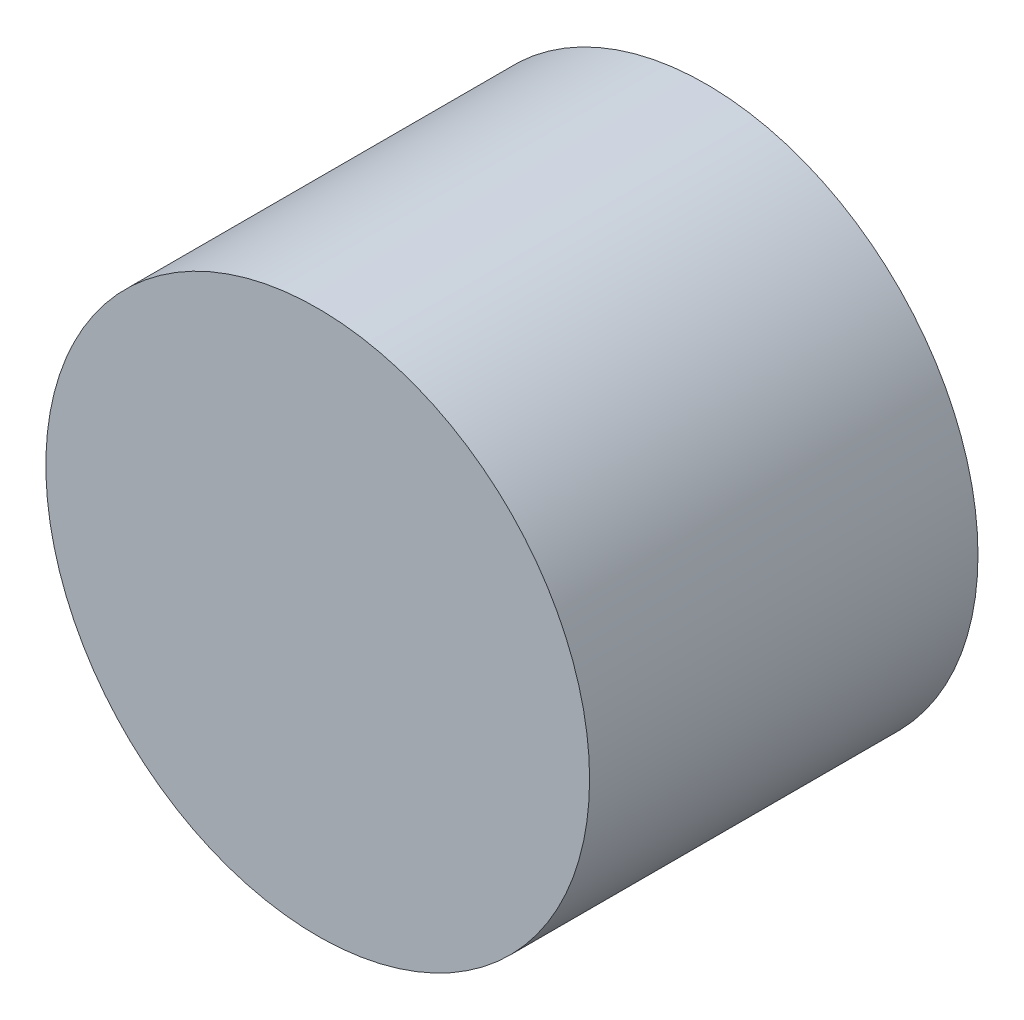
ISO-10303-21;
HEADER;
FILE_DESCRIPTION(('STEP AP214'),'2;1');
FILE_NAME('part.step','',(''),(''),'','','');
FILE_SCHEMA(('AUTOMOTIVE_DESIGN { 1 0 10303 214 1 1 1 1 }'));
ENDSEC;
DATA;
#1=APPLICATION_CONTEXT('core data for automotive mechanical design processes');
#2=APPLICATION_PROTOCOL_DEFINITION('international standard','automotive_design',2000,#1);
#3=PRODUCT_CONTEXT('',#1,'mechanical');
#4=PRODUCT('Part','Part','',(#3));
#5=PRODUCT_RELATED_PRODUCT_CATEGORY('part','',(#4));
#6=PRODUCT_DEFINITION_FORMATION('','',#4);
#7=PRODUCT_DEFINITION_CONTEXT('part definition',#1,'design');
#8=PRODUCT_DEFINITION('design','',#6,#7);
#9=PRODUCT_DEFINITION_SHAPE('','',#8);
#10=(LENGTH_UNIT() NAMED_UNIT(*) SI_UNIT(.MILLI.,.METRE.));
#11=(NAMED_UNIT(*) PLANE_ANGLE_UNIT() SI_UNIT($,.RADIAN.));
#12=(NAMED_UNIT(*) SI_UNIT($,.STERADIAN.) SOLID_ANGLE_UNIT());
#13=UNCERTAINTY_MEASURE_WITH_UNIT(LENGTH_MEASURE(1.E-05),#10,'distance_accuracy_value','');
#14=(GEOMETRIC_REPRESENTATION_CONTEXT(3) GLOBAL_UNCERTAINTY_ASSIGNED_CONTEXT((#13)) GLOBAL_UNIT_ASSIGNED_CONTEXT((#10,
#11,#12)) REPRESENTATION_CONTEXT('',''));
#15=CARTESIAN_POINT('',(0.,0.,0.));
#16=DIRECTION('',(0.,0.,1.));
#17=DIRECTION('',(1.,0.,0.));
#18=AXIS2_PLACEMENT_3D('',#15,#16,#17);
#19=CARTESIAN_POINT('',(-4.75410201159471,3.97833760996837,5.));
#20=DIRECTION('',(0.,0.,-1.));
#21=DIRECTION('',(-1.,0.,0.));
#22=AXIS2_PLACEMENT_3D('',#19,#20,#21);
#23=CYLINDRICAL_SURFACE('',#22,3.5);
#24=CARTESIAN_POINT('',(-4.75410201159471,3.97833760996837,5.));
#25=DIRECTION('',(0.,0.,1.));
#26=DIRECTION('',(1.,0.,0.));
#27=AXIS2_PLACEMENT_3D('',#24,#25,#26);
#28=CIRCLE('',#27,3.5);
#29=CARTESIAN_POINT('',(-1.25410201159471,3.97833760996837,5.));
#30=VERTEX_POINT('',#29);
#31=EDGE_CURVE('E10',#30,#30,#28,.T.);
#32=ORIENTED_EDGE('',*,*,#31,.F.);
#33=EDGE_LOOP('',(#32));
#34=FACE_BOUND('',#33,.T.);
#35=CARTESIAN_POINT('',(-4.75410201159471,3.97833760996837,0.));
#36=DIRECTION('',(0.,0.,1.));
#37=DIRECTION('',(1.,0.,0.));
#38=AXIS2_PLACEMENT_3D('',#35,#36,#37);
#39=CIRCLE('',#38,3.5);
#40=CARTESIAN_POINT('',(-1.25410201159471,3.97833760996837,0.));
#41=VERTEX_POINT('',#40);
#42=EDGE_CURVE('E33',#41,#41,#39,.T.);
#43=ORIENTED_EDGE('',*,*,#42,.T.);
#44=EDGE_LOOP('',(#43));
#45=FACE_BOUND('',#44,.T.);
#46=ADVANCED_FACE('F30',(#34,#45),#23,.T.);
#47=CARTESIAN_POINT('',(-4.75410201159471,3.97833760996837,5.));
#48=DIRECTION('',(0.,0.,1.));
#49=DIRECTION('',(1.,0.,0.));
#50=AXIS2_PLACEMENT_3D('',#47,#48,#49);
#51=PLANE('',#50);
#52=ORIENTED_EDGE('',*,*,#31,.T.);
#53=EDGE_LOOP('',(#52));
#54=FACE_BOUND('',#53,.T.);
#55=ADVANCED_FACE('F45',(#54),#51,.T.);
#56=CARTESIAN_POINT('',(-4.75410201159471,3.97833760996837,0.));
#57=DIRECTION('',(0.,0.,1.));
#58=DIRECTION('',(1.,0.,0.));
#59=AXIS2_PLACEMENT_3D('',#56,#57,#58);
#60=PLANE('',#59);
#61=ORIENTED_EDGE('',*,*,#42,.F.);
#62=EDGE_LOOP('',(#61));
#63=FACE_BOUND('',#62,.T.);
#64=ADVANCED_FACE('F43',(#63),#60,.F.);
#65=CLOSED_SHELL('',(#46,#55,#64));
#66=MANIFOLD_SOLID_BREP('B2',#65);
#67=ADVANCED_BREP_SHAPE_REPRESENTATION('',(#18,#66),#14);
#68=SHAPE_DEFINITION_REPRESENTATION(#9,#67);
ENDSEC;
END-ISO-10303-21;
